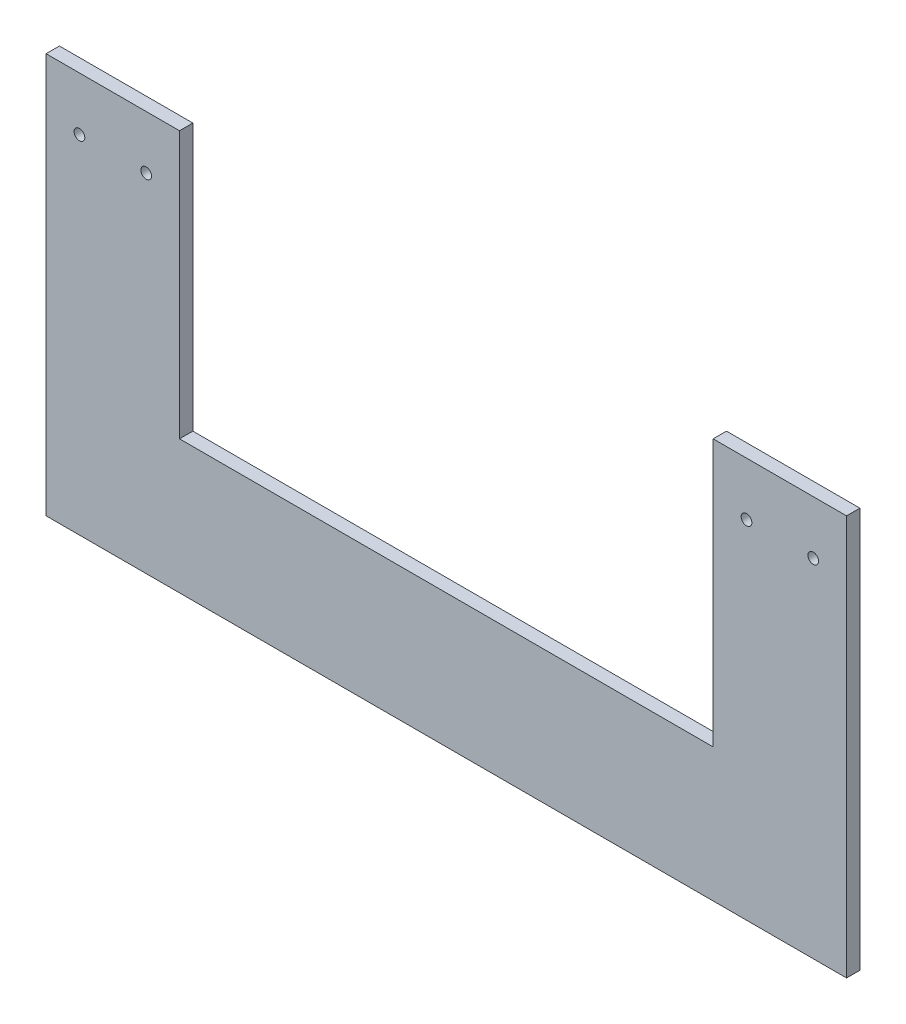
ISO-10303-21;
HEADER;
FILE_DESCRIPTION(('STEP AP214'),'2;1');
FILE_NAME('part.step','',(''),(''),'','','');
FILE_SCHEMA(('AUTOMOTIVE_DESIGN { 1 0 10303 214 1 1 1 1 }'));
ENDSEC;
DATA;
#1=APPLICATION_CONTEXT('core data for automotive mechanical design processes');
#2=APPLICATION_PROTOCOL_DEFINITION('international standard','automotive_design',2000,#1);
#3=PRODUCT_CONTEXT('',#1,'mechanical');
#4=PRODUCT('Part','Part','',(#3));
#5=PRODUCT_RELATED_PRODUCT_CATEGORY('part','',(#4));
#6=PRODUCT_DEFINITION_FORMATION('','',#4);
#7=PRODUCT_DEFINITION_CONTEXT('part definition',#1,'design');
#8=PRODUCT_DEFINITION('design','',#6,#7);
#9=PRODUCT_DEFINITION_SHAPE('','',#8);
#10=(LENGTH_UNIT() NAMED_UNIT(*) SI_UNIT(.MILLI.,.METRE.));
#11=(NAMED_UNIT(*) PLANE_ANGLE_UNIT() SI_UNIT($,.RADIAN.));
#12=(NAMED_UNIT(*) SI_UNIT($,.STERADIAN.) SOLID_ANGLE_UNIT());
#13=UNCERTAINTY_MEASURE_WITH_UNIT(LENGTH_MEASURE(1.E-05),#10,'distance_accuracy_value','');
#14=(GEOMETRIC_REPRESENTATION_CONTEXT(3) GLOBAL_UNCERTAINTY_ASSIGNED_CONTEXT((#13)) GLOBAL_UNIT_ASSIGNED_CONTEXT((#10,
#11,#12)) REPRESENTATION_CONTEXT('',''));
#15=CARTESIAN_POINT('',(0.,0.,0.));
#16=DIRECTION('',(0.,0.,1.));
#17=DIRECTION('',(1.,0.,0.));
#18=AXIS2_PLACEMENT_3D('',#15,#16,#17);
#19=CARTESIAN_POINT('',(0.,0.,5.));
#20=DIRECTION('',(0.,0.,1.));
#21=DIRECTION('',(1.,0.,0.));
#22=AXIS2_PLACEMENT_3D('',#19,#20,#21);
#23=PLANE('',#22);
#24=CARTESIAN_POINT('',(207.78728853564,76.2495724056163,5.));
#25=DIRECTION('',(0.,0.,1.));
#26=DIRECTION('',(-1.,0.,0.));
#27=AXIS2_PLACEMENT_3D('',#24,#25,#26);
#28=CIRCLE('',#27,2.);
#29=CARTESIAN_POINT('',(205.78728853564,76.2495724056163,5.));
#30=VERTEX_POINT('',#29);
#31=EDGE_CURVE('E188',#30,#30,#28,.T.);
#32=ORIENTED_EDGE('',*,*,#31,.F.);
#33=EDGE_LOOP('',(#32));
#34=FACE_BOUND('',#33,.T.);
#35=CARTESIAN_POINT('',(-42.2127114643598,76.2495724056163,5.));
#36=DIRECTION('',(0.,0.,1.));
#37=DIRECTION('',(1.,0.,0.));
#38=AXIS2_PLACEMENT_3D('',#35,#36,#37);
#39=CIRCLE('',#38,2.);
#40=CARTESIAN_POINT('',(-40.2127114643598,76.2495724056163,5.));
#41=VERTEX_POINT('',#40);
#42=EDGE_CURVE('E134',#41,#41,#39,.T.);
#43=ORIENTED_EDGE('',*,*,#42,.F.);
#44=EDGE_LOOP('',(#43));
#45=FACE_BOUND('',#44,.T.);
#46=DIRECTION('',(0.,-1.,0.));
#47=VECTOR('',#46,1.);
#48=CARTESIAN_POINT('',(-54.7127114643598,96.2495724056163,5.));
#49=LINE('',#48,#47);
#50=CARTESIAN_POINT('',(-54.7127114643598,96.2495724056163,5.));
#51=VERTEX_POINT('',#50);
#52=CARTESIAN_POINT('',(-54.7127114643598,-53.7504275943836,5.));
#53=VERTEX_POINT('',#52);
#54=EDGE_CURVE('E145',#51,#53,#49,.T.);
#55=ORIENTED_EDGE('',*,*,#54,.T.);
#56=DIRECTION('',(1.,0.,0.));
#57=VECTOR('',#56,1.);
#58=CARTESIAN_POINT('',(-54.7127114643598,-53.7504275943836,5.));
#59=LINE('',#58,#57);
#60=CARTESIAN_POINT('',(245.28728853564,-53.7504275943836,5.));
#61=VERTEX_POINT('',#60);
#62=EDGE_CURVE('E93',#53,#61,#59,.T.);
#63=ORIENTED_EDGE('',*,*,#62,.T.);
#64=DIRECTION('',(0.,1.,0.));
#65=VECTOR('',#64,1.);
#66=CARTESIAN_POINT('',(245.28728853564,96.2495724056163,5.));
#67=LINE('',#66,#65);
#68=CARTESIAN_POINT('',(245.28728853564,96.2495724056163,5.));
#69=VERTEX_POINT('',#68);
#70=EDGE_CURVE('E160',#61,#69,#67,.T.);
#71=ORIENTED_EDGE('',*,*,#70,.T.);
#72=DIRECTION('',(-1.,0.,0.));
#73=VECTOR('',#72,1.);
#74=CARTESIAN_POINT('',(195.28728853564,96.2495724056163,5.));
#75=LINE('',#74,#73);
#76=CARTESIAN_POINT('',(195.28728853564,96.2495724056163,5.));
#77=VERTEX_POINT('',#76);
#78=EDGE_CURVE('E173',#69,#77,#75,.T.);
#79=ORIENTED_EDGE('',*,*,#78,.T.);
#80=DIRECTION('',(0.,-1.,0.));
#81=VECTOR('',#80,1.);
#82=CARTESIAN_POINT('',(195.28728853564,96.2495724056163,5.));
#83=LINE('',#82,#81);
#84=CARTESIAN_POINT('',(195.28728853564,-3.75042759438364,5.));
#85=VERTEX_POINT('',#84);
#86=EDGE_CURVE('E112',#77,#85,#83,.T.);
#87=ORIENTED_EDGE('',*,*,#86,.T.);
#88=DIRECTION('',(-1.,0.,0.));
#89=VECTOR('',#88,1.);
#90=CARTESIAN_POINT('',(-4.71271146435982,-3.75042759438364,5.));
#91=LINE('',#90,#89);
#92=CARTESIAN_POINT('',(-4.71271146435982,-3.75042759438364,5.));
#93=VERTEX_POINT('',#92);
#94=EDGE_CURVE('E106',#85,#93,#91,.T.);
#95=ORIENTED_EDGE('',*,*,#94,.T.);
#96=DIRECTION('',(0.,1.,0.));
#97=VECTOR('',#96,1.);
#98=CARTESIAN_POINT('',(-4.71271146435982,96.2495724056163,5.));
#99=LINE('',#98,#97);
#100=CARTESIAN_POINT('',(-4.71271146435982,96.2495724056163,5.));
#101=VERTEX_POINT('',#100);
#102=EDGE_CURVE('E110',#93,#101,#99,.T.);
#103=ORIENTED_EDGE('',*,*,#102,.T.);
#104=DIRECTION('',(-1.,0.,0.));
#105=VECTOR('',#104,1.);
#106=CARTESIAN_POINT('',(-54.7127114643598,96.2495724056163,5.));
#107=LINE('',#106,#105);
#108=EDGE_CURVE('E50',#101,#51,#107,.T.);
#109=ORIENTED_EDGE('',*,*,#108,.T.);
#110=EDGE_LOOP('',(#55,#63,#71,#79,#87,#95,#103,#109));
#111=FACE_BOUND('',#110,.T.);
#112=CARTESIAN_POINT('',(232.78728853564,76.2495724056163,5.));
#113=DIRECTION('',(0.,0.,1.));
#114=DIRECTION('',(1.,0.,0.));
#115=AXIS2_PLACEMENT_3D('',#112,#113,#114);
#116=CIRCLE('',#115,2.);
#117=CARTESIAN_POINT('',(234.78728853564,76.2495724056163,5.));
#118=VERTEX_POINT('',#117);
#119=EDGE_CURVE('E182',#118,#118,#116,.T.);
#120=ORIENTED_EDGE('',*,*,#119,.F.);
#121=EDGE_LOOP('',(#120));
#122=FACE_BOUND('',#121,.T.);
#123=CARTESIAN_POINT('',(-17.2127114643598,76.2495724056163,5.));
#124=DIRECTION('',(0.,0.,1.));
#125=DIRECTION('',(-1.,0.,0.));
#126=AXIS2_PLACEMENT_3D('',#123,#124,#125);
#127=CIRCLE('',#126,2.);
#128=CARTESIAN_POINT('',(-19.2127114643598,76.2495724056163,5.));
#129=VERTEX_POINT('',#128);
#130=EDGE_CURVE('E194',#129,#129,#127,.T.);
#131=ORIENTED_EDGE('',*,*,#130,.F.);
#132=EDGE_LOOP('',(#131));
#133=FACE_BOUND('',#132,.T.);
#134=ADVANCED_FACE('F33',(#34,#45,#111,#122,#133),#23,.T.);
#135=CARTESIAN_POINT('',(0.,0.,0.));
#136=DIRECTION('',(0.,0.,1.));
#137=DIRECTION('',(1.,0.,0.));
#138=AXIS2_PLACEMENT_3D('',#135,#136,#137);
#139=PLANE('',#138);
#140=CARTESIAN_POINT('',(207.78728853564,76.2495724056163,0.));
#141=DIRECTION('',(0.,0.,1.));
#142=DIRECTION('',(-1.,0.,0.));
#143=AXIS2_PLACEMENT_3D('',#140,#141,#142);
#144=CIRCLE('',#143,2.);
#145=CARTESIAN_POINT('',(205.78728853564,76.2495724056163,0.));
#146=VERTEX_POINT('',#145);
#147=EDGE_CURVE('E191',#146,#146,#144,.T.);
#148=ORIENTED_EDGE('',*,*,#147,.T.);
#149=EDGE_LOOP('',(#148));
#150=FACE_BOUND('',#149,.T.);
#151=CARTESIAN_POINT('',(-42.2127114643598,76.2495724056163,0.));
#152=DIRECTION('',(0.,0.,1.));
#153=DIRECTION('',(1.,0.,0.));
#154=AXIS2_PLACEMENT_3D('',#151,#152,#153);
#155=CIRCLE('',#154,2.);
#156=CARTESIAN_POINT('',(-40.2127114643598,76.2495724056163,0.));
#157=VERTEX_POINT('',#156);
#158=EDGE_CURVE('E179',#157,#157,#155,.T.);
#159=ORIENTED_EDGE('',*,*,#158,.T.);
#160=EDGE_LOOP('',(#159));
#161=FACE_BOUND('',#160,.T.);
#162=DIRECTION('',(0.,-1.,0.));
#163=VECTOR('',#162,1.);
#164=CARTESIAN_POINT('',(-54.7127114643598,96.2495724056163,0.));
#165=LINE('',#164,#163);
#166=CARTESIAN_POINT('',(-54.7127114643598,96.2495724056163,0.));
#167=VERTEX_POINT('',#166);
#168=CARTESIAN_POINT('',(-54.7127114643598,-53.7504275943836,0.));
#169=VERTEX_POINT('',#168);
#170=EDGE_CURVE('E130',#167,#169,#165,.T.);
#171=ORIENTED_EDGE('',*,*,#170,.F.);
#172=DIRECTION('',(-1.,0.,0.));
#173=VECTOR('',#172,1.);
#174=CARTESIAN_POINT('',(-54.7127114643598,96.2495724056163,0.));
#175=LINE('',#174,#173);
#176=CARTESIAN_POINT('',(-4.71271146435982,96.2495724056163,0.));
#177=VERTEX_POINT('',#176);
#178=EDGE_CURVE('E85',#177,#167,#175,.T.);
#179=ORIENTED_EDGE('',*,*,#178,.F.);
#180=DIRECTION('',(0.,1.,0.));
#181=VECTOR('',#180,1.);
#182=CARTESIAN_POINT('',(-4.71271146435982,96.2495724056163,0.));
#183=LINE('',#182,#181);
#184=CARTESIAN_POINT('',(-4.71271146435982,-3.75042759438364,0.));
#185=VERTEX_POINT('',#184);
#186=EDGE_CURVE('E79',#185,#177,#183,.T.);
#187=ORIENTED_EDGE('',*,*,#186,.F.);
#188=DIRECTION('',(-1.,0.,0.));
#189=VECTOR('',#188,1.);
#190=CARTESIAN_POINT('',(-4.71271146435982,-3.75042759438364,0.));
#191=LINE('',#190,#189);
#192=CARTESIAN_POINT('',(195.28728853564,-3.75042759438364,0.));
#193=VERTEX_POINT('',#192);
#194=EDGE_CURVE('E120',#193,#185,#191,.T.);
#195=ORIENTED_EDGE('',*,*,#194,.F.);
#196=DIRECTION('',(0.,-1.,0.));
#197=VECTOR('',#196,1.);
#198=CARTESIAN_POINT('',(195.28728853564,96.2495724056163,0.));
#199=LINE('',#198,#197);
#200=CARTESIAN_POINT('',(195.28728853564,96.2495724056163,0.));
#201=VERTEX_POINT('',#200);
#202=EDGE_CURVE('E140',#201,#193,#199,.T.);
#203=ORIENTED_EDGE('',*,*,#202,.F.);
#204=DIRECTION('',(-1.,0.,0.));
#205=VECTOR('',#204,1.);
#206=CARTESIAN_POINT('',(195.28728853564,96.2495724056163,0.));
#207=LINE('',#206,#205);
#208=CARTESIAN_POINT('',(245.28728853564,96.2495724056163,0.));
#209=VERTEX_POINT('',#208);
#210=EDGE_CURVE('E138',#209,#201,#207,.T.);
#211=ORIENTED_EDGE('',*,*,#210,.F.);
#212=DIRECTION('',(0.,1.,0.));
#213=VECTOR('',#212,1.);
#214=CARTESIAN_POINT('',(245.28728853564,96.2495724056163,0.));
#215=LINE('',#214,#213);
#216=CARTESIAN_POINT('',(245.28728853564,-53.7504275943836,0.));
#217=VERTEX_POINT('',#216);
#218=EDGE_CURVE('E136',#217,#209,#215,.T.);
#219=ORIENTED_EDGE('',*,*,#218,.F.);
#220=DIRECTION('',(1.,0.,0.));
#221=VECTOR('',#220,1.);
#222=CARTESIAN_POINT('',(-54.7127114643598,-53.7504275943836,0.));
#223=LINE('',#222,#221);
#224=EDGE_CURVE('E133',#169,#217,#223,.T.);
#225=ORIENTED_EDGE('',*,*,#224,.F.);
#226=EDGE_LOOP('',(#171,#179,#187,#195,#203,#211,#219,#225));
#227=FACE_BOUND('',#226,.T.);
#228=CARTESIAN_POINT('',(232.78728853564,76.2495724056163,0.));
#229=DIRECTION('',(0.,0.,1.));
#230=DIRECTION('',(1.,0.,0.));
#231=AXIS2_PLACEMENT_3D('',#228,#229,#230);
#232=CIRCLE('',#231,2.);
#233=CARTESIAN_POINT('',(234.78728853564,76.2495724056163,0.));
#234=VERTEX_POINT('',#233);
#235=EDGE_CURVE('E185',#234,#234,#232,.T.);
#236=ORIENTED_EDGE('',*,*,#235,.T.);
#237=EDGE_LOOP('',(#236));
#238=FACE_BOUND('',#237,.T.);
#239=CARTESIAN_POINT('',(-17.2127114643598,76.2495724056163,0.));
#240=DIRECTION('',(0.,0.,1.));
#241=DIRECTION('',(-1.,0.,0.));
#242=AXIS2_PLACEMENT_3D('',#239,#240,#241);
#243=CIRCLE('',#242,2.);
#244=CARTESIAN_POINT('',(-19.2127114643598,76.2495724056163,0.));
#245=VERTEX_POINT('',#244);
#246=EDGE_CURVE('E197',#245,#245,#243,.T.);
#247=ORIENTED_EDGE('',*,*,#246,.T.);
#248=EDGE_LOOP('',(#247));
#249=FACE_BOUND('',#248,.T.);
#250=ADVANCED_FACE('F164',(#150,#161,#227,#238,#249),#139,.F.);
#251=CARTESIAN_POINT('',(-54.7127114643598,96.2495724056163,5.));
#252=DIRECTION('',(1.,0.,0.));
#253=DIRECTION('',(0.,1.,0.));
#254=AXIS2_PLACEMENT_3D('',#251,#252,#253);
#255=PLANE('',#254);
#256=ORIENTED_EDGE('',*,*,#170,.T.);
#257=DIRECTION('',(0.,0.,-1.));
#258=VECTOR('',#257,1.);
#259=CARTESIAN_POINT('',(-54.7127114643598,-53.7504275943836,5.));
#260=LINE('',#259,#258);
#261=EDGE_CURVE('E11',#53,#169,#260,.T.);
#262=ORIENTED_EDGE('',*,*,#261,.F.);
#263=ORIENTED_EDGE('',*,*,#54,.F.);
#264=DIRECTION('',(0.,0.,-1.));
#265=VECTOR('',#264,1.);
#266=CARTESIAN_POINT('',(-54.7127114643598,96.2495724056163,5.));
#267=LINE('',#266,#265);
#268=EDGE_CURVE('E126',#51,#167,#267,.T.);
#269=ORIENTED_EDGE('',*,*,#268,.T.);
#270=EDGE_LOOP('',(#256,#262,#263,#269));
#271=FACE_BOUND('',#270,.T.);
#272=ADVANCED_FACE('F35',(#271),#255,.F.);
#273=CARTESIAN_POINT('',(-54.7127114643598,-53.7504275943836,5.));
#274=DIRECTION('',(0.,1.,0.));
#275=DIRECTION('',(0.,0.,1.));
#276=AXIS2_PLACEMENT_3D('',#273,#274,#275);
#277=PLANE('',#276);
#278=ORIENTED_EDGE('',*,*,#224,.T.);
#279=DIRECTION('',(0.,0.,-1.));
#280=VECTOR('',#279,1.);
#281=CARTESIAN_POINT('',(245.28728853564,-53.7504275943836,5.));
#282=LINE('',#281,#280);
#283=EDGE_CURVE('E42',#61,#217,#282,.T.);
#284=ORIENTED_EDGE('',*,*,#283,.F.);
#285=ORIENTED_EDGE('',*,*,#62,.F.);
#286=ORIENTED_EDGE('',*,*,#261,.T.);
#287=EDGE_LOOP('',(#278,#284,#285,#286));
#288=FACE_BOUND('',#287,.T.);
#289=ADVANCED_FACE('F232',(#288),#277,.F.);
#290=CARTESIAN_POINT('',(245.28728853564,96.2495724056163,5.));
#291=DIRECTION('',(-1.,0.,0.));
#292=DIRECTION('',(0.,-1.,0.));
#293=AXIS2_PLACEMENT_3D('',#290,#291,#292);
#294=PLANE('',#293);
#295=ORIENTED_EDGE('',*,*,#218,.T.);
#296=DIRECTION('',(0.,0.,-1.));
#297=VECTOR('',#296,1.);
#298=CARTESIAN_POINT('',(245.28728853564,96.2495724056163,5.));
#299=LINE('',#298,#297);
#300=EDGE_CURVE('E152',#69,#209,#299,.T.);
#301=ORIENTED_EDGE('',*,*,#300,.F.);
#302=ORIENTED_EDGE('',*,*,#70,.F.);
#303=ORIENTED_EDGE('',*,*,#283,.T.);
#304=EDGE_LOOP('',(#295,#301,#302,#303));
#305=FACE_BOUND('',#304,.T.);
#306=ADVANCED_FACE('F158',(#305),#294,.F.);
#307=CARTESIAN_POINT('',(195.28728853564,96.2495724056163,5.));
#308=DIRECTION('',(0.,-1.,0.));
#309=DIRECTION('',(0.,0.,-1.));
#310=AXIS2_PLACEMENT_3D('',#307,#308,#309);
#311=PLANE('',#310);
#312=ORIENTED_EDGE('',*,*,#210,.T.);
#313=DIRECTION('',(0.,0.,-1.));
#314=VECTOR('',#313,1.);
#315=CARTESIAN_POINT('',(195.28728853564,96.2495724056163,5.));
#316=LINE('',#315,#314);
#317=EDGE_CURVE('E149',#77,#201,#316,.T.);
#318=ORIENTED_EDGE('',*,*,#317,.F.);
#319=ORIENTED_EDGE('',*,*,#78,.F.);
#320=ORIENTED_EDGE('',*,*,#300,.T.);
#321=EDGE_LOOP('',(#312,#318,#319,#320));
#322=FACE_BOUND('',#321,.T.);
#323=ADVANCED_FACE('F169',(#322),#311,.F.);
#324=CARTESIAN_POINT('',(195.28728853564,96.2495724056163,5.));
#325=DIRECTION('',(1.,0.,0.));
#326=DIRECTION('',(0.,1.,0.));
#327=AXIS2_PLACEMENT_3D('',#324,#325,#326);
#328=PLANE('',#327);
#329=ORIENTED_EDGE('',*,*,#202,.T.);
#330=DIRECTION('',(0.,0.,-1.));
#331=VECTOR('',#330,1.);
#332=CARTESIAN_POINT('',(195.28728853564,-3.75042759438364,5.));
#333=LINE('',#332,#331);
#334=EDGE_CURVE('E121',#85,#193,#333,.T.);
#335=ORIENTED_EDGE('',*,*,#334,.F.);
#336=ORIENTED_EDGE('',*,*,#86,.F.);
#337=ORIENTED_EDGE('',*,*,#317,.T.);
#338=EDGE_LOOP('',(#329,#335,#336,#337));
#339=FACE_BOUND('',#338,.T.);
#340=ADVANCED_FACE('F172',(#339),#328,.F.);
#341=CARTESIAN_POINT('',(-4.71271146435982,-3.75042759438364,5.));
#342=DIRECTION('',(0.,-1.,0.));
#343=DIRECTION('',(0.,0.,-1.));
#344=AXIS2_PLACEMENT_3D('',#341,#342,#343);
#345=PLANE('',#344);
#346=ORIENTED_EDGE('',*,*,#194,.T.);
#347=DIRECTION('',(0.,0.,-1.));
#348=VECTOR('',#347,1.);
#349=CARTESIAN_POINT('',(-4.71271146435982,-3.75042759438364,5.));
#350=LINE('',#349,#348);
#351=EDGE_CURVE('E117',#93,#185,#350,.T.);
#352=ORIENTED_EDGE('',*,*,#351,.F.);
#353=ORIENTED_EDGE('',*,*,#94,.F.);
#354=ORIENTED_EDGE('',*,*,#334,.T.);
#355=EDGE_LOOP('',(#346,#352,#353,#354));
#356=FACE_BOUND('',#355,.T.);
#357=ADVANCED_FACE('F118',(#356),#345,.F.);
#358=CARTESIAN_POINT('',(-4.71271146435982,96.2495724056163,5.));
#359=DIRECTION('',(-1.,0.,0.));
#360=DIRECTION('',(0.,0.,1.));
#361=AXIS2_PLACEMENT_3D('',#358,#359,#360);
#362=PLANE('',#361);
#363=ORIENTED_EDGE('',*,*,#186,.T.);
#364=DIRECTION('',(0.,0.,-1.));
#365=VECTOR('',#364,1.);
#366=CARTESIAN_POINT('',(-4.71271146435982,96.2495724056163,5.));
#367=LINE('',#366,#365);
#368=EDGE_CURVE('E122',#101,#177,#367,.T.);
#369=ORIENTED_EDGE('',*,*,#368,.F.);
#370=ORIENTED_EDGE('',*,*,#102,.F.);
#371=ORIENTED_EDGE('',*,*,#351,.T.);
#372=EDGE_LOOP('',(#363,#369,#370,#371));
#373=FACE_BOUND('',#372,.T.);
#374=ADVANCED_FACE('F124',(#373),#362,.F.);
#375=CARTESIAN_POINT('',(-54.7127114643598,96.2495724056163,5.));
#376=DIRECTION('',(0.,-1.,0.));
#377=DIRECTION('',(0.,0.,-1.));
#378=AXIS2_PLACEMENT_3D('',#375,#376,#377);
#379=PLANE('',#378);
#380=ORIENTED_EDGE('',*,*,#178,.T.);
#381=ORIENTED_EDGE('',*,*,#268,.F.);
#382=ORIENTED_EDGE('',*,*,#108,.F.);
#383=ORIENTED_EDGE('',*,*,#368,.T.);
#384=EDGE_LOOP('',(#380,#381,#382,#383));
#385=FACE_BOUND('',#384,.T.);
#386=ADVANCED_FACE('F220',(#385),#379,.F.);
#387=CARTESIAN_POINT('',(-42.2127114643598,76.2495724056163,5.));
#388=DIRECTION('',(0.,0.,-1.));
#389=DIRECTION('',(-1.,0.,0.));
#390=AXIS2_PLACEMENT_3D('',#387,#388,#389);
#391=CYLINDRICAL_SURFACE('',#390,2.);
#392=ORIENTED_EDGE('',*,*,#42,.T.);
#393=EDGE_LOOP('',(#392));
#394=FACE_BOUND('',#393,.T.);
#395=ORIENTED_EDGE('',*,*,#158,.F.);
#396=EDGE_LOOP('',(#395));
#397=FACE_BOUND('',#396,.T.);
#398=ADVANCED_FACE('F217',(#394,#397),#391,.F.);
#399=CARTESIAN_POINT('',(232.78728853564,76.2495724056163,5.));
#400=DIRECTION('',(0.,0.,-1.));
#401=DIRECTION('',(-1.,0.,0.));
#402=AXIS2_PLACEMENT_3D('',#399,#400,#401);
#403=CYLINDRICAL_SURFACE('',#402,2.);
#404=ORIENTED_EDGE('',*,*,#119,.T.);
#405=EDGE_LOOP('',(#404));
#406=FACE_BOUND('',#405,.T.);
#407=ORIENTED_EDGE('',*,*,#235,.F.);
#408=EDGE_LOOP('',(#407));
#409=FACE_BOUND('',#408,.T.);
#410=ADVANCED_FACE('F296',(#406,#409),#403,.F.);
#411=CARTESIAN_POINT('',(207.78728853564,76.2495724056163,5.));
#412=DIRECTION('',(0.,0.,-1.));
#413=DIRECTION('',(-1.,0.,0.));
#414=AXIS2_PLACEMENT_3D('',#411,#412,#413);
#415=CYLINDRICAL_SURFACE('',#414,2.);
#416=ORIENTED_EDGE('',*,*,#31,.T.);
#417=EDGE_LOOP('',(#416));
#418=FACE_BOUND('',#417,.T.);
#419=ORIENTED_EDGE('',*,*,#147,.F.);
#420=EDGE_LOOP('',(#419));
#421=FACE_BOUND('',#420,.T.);
#422=ADVANCED_FACE('F304',(#418,#421),#415,.F.);
#423=CARTESIAN_POINT('',(-17.2127114643598,76.2495724056163,5.));
#424=DIRECTION('',(0.,0.,-1.));
#425=DIRECTION('',(-1.,0.,0.));
#426=AXIS2_PLACEMENT_3D('',#423,#424,#425);
#427=CYLINDRICAL_SURFACE('',#426,2.);
#428=ORIENTED_EDGE('',*,*,#130,.T.);
#429=EDGE_LOOP('',(#428));
#430=FACE_BOUND('',#429,.T.);
#431=ORIENTED_EDGE('',*,*,#246,.F.);
#432=EDGE_LOOP('',(#431));
#433=FACE_BOUND('',#432,.T.);
#434=ADVANCED_FACE('F203',(#430,#433),#427,.F.);
#435=CLOSED_SHELL('',(#134,#250,#272,#289,#306,#323,#340,#357,#374,#386,#398,#410,#422,#434));
#436=MANIFOLD_SOLID_BREP('B2',#435);
#437=ADVANCED_BREP_SHAPE_REPRESENTATION('',(#18,#436),#14);
#438=SHAPE_DEFINITION_REPRESENTATION(#9,#437);
ENDSEC;
END-ISO-10303-21;
